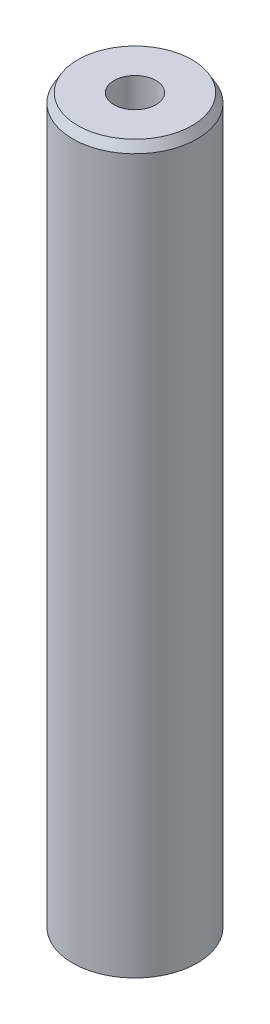
ISO-10303-21;
HEADER;
FILE_DESCRIPTION(('STEP AP214'),'2;1');
FILE_NAME('part.step','',(''),(''),'','','');
FILE_SCHEMA(('AUTOMOTIVE_DESIGN { 1 0 10303 214 1 1 1 1 }'));
ENDSEC;
DATA;
#1=APPLICATION_CONTEXT('core data for automotive mechanical design processes');
#2=APPLICATION_PROTOCOL_DEFINITION('international standard','automotive_design',2000,#1);
#3=PRODUCT_CONTEXT('',#1,'mechanical');
#4=PRODUCT('Part','Part','',(#3));
#5=PRODUCT_RELATED_PRODUCT_CATEGORY('part','',(#4));
#6=PRODUCT_DEFINITION_FORMATION('','',#4);
#7=PRODUCT_DEFINITION_CONTEXT('part definition',#1,'design');
#8=PRODUCT_DEFINITION('design','',#6,#7);
#9=PRODUCT_DEFINITION_SHAPE('','',#8);
#10=(LENGTH_UNIT() NAMED_UNIT(*) SI_UNIT(.MILLI.,.METRE.));
#11=(NAMED_UNIT(*) PLANE_ANGLE_UNIT() SI_UNIT($,.RADIAN.));
#12=(NAMED_UNIT(*) SI_UNIT($,.STERADIAN.) SOLID_ANGLE_UNIT());
#13=UNCERTAINTY_MEASURE_WITH_UNIT(LENGTH_MEASURE(1.E-05),#10,'distance_accuracy_value','');
#14=(GEOMETRIC_REPRESENTATION_CONTEXT(3) GLOBAL_UNCERTAINTY_ASSIGNED_CONTEXT((#13)) GLOBAL_UNIT_ASSIGNED_CONTEXT((#10,
#11,#12)) REPRESENTATION_CONTEXT('',''));
#15=CARTESIAN_POINT('',(0.,0.,0.));
#16=DIRECTION('',(0.,0.,1.));
#17=DIRECTION('',(1.,0.,0.));
#18=AXIS2_PLACEMENT_3D('',#15,#16,#17);
#19=CARTESIAN_POINT('',(0.,116.868068885412,0.));
#20=DIRECTION('',(0.,-1.,0.));
#21=DIRECTION('',(0.,0.,-1.));
#22=AXIS2_PLACEMENT_3D('',#19,#20,#21);
#23=CYLINDRICAL_SURFACE('',#22,10.);
#24=CARTESIAN_POINT('',(0.,115.429796169581,0.));
#25=DIRECTION('',(0.,1.,0.));
#26=DIRECTION('',(0.,0.,1.));
#27=AXIS2_PLACEMENT_3D('',#24,#25,#26);
#28=CIRCLE('',#27,10.);
#29=CARTESIAN_POINT('',(0.,115.429796169581,10.));
#30=VERTEX_POINT('',#29);
#31=EDGE_CURVE('E50',#30,#30,#28,.F.);
#32=ORIENTED_EDGE('',*,*,#31,.T.);
#33=EDGE_LOOP('',(#32));
#34=FACE_BOUND('',#33,.T.);
#35=CARTESIAN_POINT('',(0.,0.830387139653249,0.));
#36=DIRECTION('',(0.,1.,0.));
#37=DIRECTION('',(0.,0.,1.));
#38=AXIS2_PLACEMENT_3D('',#35,#36,#37);
#39=CIRCLE('',#38,10.);
#40=CARTESIAN_POINT('',(0.,0.830387139653249,10.));
#41=VERTEX_POINT('',#40);
#42=EDGE_CURVE('E51',#41,#41,#39,.T.);
#43=ORIENTED_EDGE('',*,*,#42,.T.);
#44=EDGE_LOOP('',(#43));
#45=FACE_BOUND('',#44,.T.);
#46=ADVANCED_FACE('F39',(#34,#45),#23,.T.);
#47=CARTESIAN_POINT('',(0.,116.868068885412,0.));
#48=DIRECTION('',(0.,1.,0.));
#49=DIRECTION('',(0.,0.,1.));
#50=AXIS2_PLACEMENT_3D('',#47,#48,#49);
#51=PLANE('',#50);
#52=CARTESIAN_POINT('',(0.,116.868068885412,0.));
#53=DIRECTION('',(0.,1.,0.));
#54=DIRECTION('',(0.,0.,1.));
#55=AXIS2_PLACEMENT_3D('',#52,#53,#54);
#56=CIRCLE('',#55,9.16961286034677);
#57=CARTESIAN_POINT('',(0.,116.868068885412,9.16961286034677));
#58=VERTEX_POINT('',#57);
#59=EDGE_CURVE('E54',#58,#58,#56,.T.);
#60=ORIENTED_EDGE('',*,*,#59,.T.);
#61=EDGE_LOOP('',(#60));
#62=FACE_BOUND('',#61,.T.);
#63=CARTESIAN_POINT('',(0.,116.868068885412,0.));
#64=DIRECTION('',(0.,1.,0.));
#65=DIRECTION('',(0.,0.,1.));
#66=AXIS2_PLACEMENT_3D('',#63,#64,#65);
#67=CIRCLE('',#66,3.37114388248551);
#68=CARTESIAN_POINT('',(0.,116.868068885412,3.37114388248551));
#69=VERTEX_POINT('',#68);
#70=EDGE_CURVE('E58',#69,#69,#67,.T.);
#71=ORIENTED_EDGE('',*,*,#70,.F.);
#72=EDGE_LOOP('',(#71));
#73=FACE_BOUND('',#72,.T.);
#74=ADVANCED_FACE('F69',(#62,#73),#51,.T.);
#75=CARTESIAN_POINT('',(0.,0.,0.));
#76=DIRECTION('',(0.,1.,0.));
#77=DIRECTION('',(0.,0.,1.));
#78=AXIS2_PLACEMENT_3D('',#75,#76,#77);
#79=PLANE('',#78);
#80=CARTESIAN_POINT('',(0.,0.,0.));
#81=DIRECTION('',(0.,1.,0.));
#82=DIRECTION('',(0.,0.,1.));
#83=AXIS2_PLACEMENT_3D('',#80,#81,#82);
#84=CIRCLE('',#83,8.56172728416876);
#85=CARTESIAN_POINT('',(0.,0.,8.56172728416876));
#86=VERTEX_POINT('',#85);
#87=EDGE_CURVE('E10',#86,#86,#84,.F.);
#88=ORIENTED_EDGE('',*,*,#87,.T.);
#89=EDGE_LOOP('',(#88));
#90=FACE_BOUND('',#89,.T.);
#91=CARTESIAN_POINT('',(0.,0.,0.));
#92=DIRECTION('',(0.,1.,0.));
#93=DIRECTION('',(0.,0.,1.));
#94=AXIS2_PLACEMENT_3D('',#91,#92,#93);
#95=CIRCLE('',#94,3.37114388248551);
#96=CARTESIAN_POINT('',(0.,0.,3.37114388248551));
#97=VERTEX_POINT('',#96);
#98=EDGE_CURVE('E63',#97,#97,#95,.T.);
#99=ORIENTED_EDGE('',*,*,#98,.T.);
#100=EDGE_LOOP('',(#99));
#101=FACE_BOUND('',#100,.T.);
#102=ADVANCED_FACE('F75',(#90,#101),#79,.F.);
#103=CARTESIAN_POINT('',(0.,116.868068885412,0.));
#104=DIRECTION('',(0.,-1.,0.));
#105=DIRECTION('',(0.,0.,-1.));
#106=AXIS2_PLACEMENT_3D('',#103,#104,#105);
#107=CYLINDRICAL_SURFACE('',#106,3.37114388248551);
#108=ORIENTED_EDGE('',*,*,#70,.T.);
#109=EDGE_LOOP('',(#108));
#110=FACE_BOUND('',#109,.T.);
#111=ORIENTED_EDGE('',*,*,#98,.F.);
#112=EDGE_LOOP('',(#111));
#113=FACE_BOUND('',#112,.T.);
#114=ADVANCED_FACE('F70',(#110,#113),#107,.F.);
#115=CARTESIAN_POINT('',(0.,116.868068885412,0.));
#116=DIRECTION('',(0.,-1.,0.));
#117=DIRECTION('',(0.,0.,-1.));
#118=AXIS2_PLACEMENT_3D('',#115,#116,#117);
#119=CONICAL_SURFACE('',#118,9.16961286034677,0.523598775598296);
#120=ORIENTED_EDGE('',*,*,#31,.F.);
#121=EDGE_LOOP('',(#120));
#122=FACE_BOUND('',#121,.T.);
#123=ORIENTED_EDGE('',*,*,#59,.F.);
#124=EDGE_LOOP('',(#123));
#125=FACE_BOUND('',#124,.T.);
#126=ADVANCED_FACE('F81',(#122,#125),#119,.T.);
#127=CARTESIAN_POINT('',(0.,0.830387139653249,0.));
#128=DIRECTION('',(0.,1.,0.));
#129=DIRECTION('',(0.,0.,1.));
#130=AXIS2_PLACEMENT_3D('',#127,#128,#129);
#131=CONICAL_SURFACE('',#130,10.,1.0471975511966);
#132=ORIENTED_EDGE('',*,*,#87,.F.);
#133=EDGE_LOOP('',(#132));
#134=FACE_BOUND('',#133,.T.);
#135=ORIENTED_EDGE('',*,*,#42,.F.);
#136=EDGE_LOOP('',(#135));
#137=FACE_BOUND('',#136,.T.);
#138=ADVANCED_FACE('F45',(#134,#137),#131,.T.);
#139=CLOSED_SHELL('',(#46,#74,#102,#114,#126,#138));
#140=MANIFOLD_SOLID_BREP('B2',#139);
#141=ADVANCED_BREP_SHAPE_REPRESENTATION('',(#18,#140),#14);
#142=SHAPE_DEFINITION_REPRESENTATION(#9,#141);
ENDSEC;
END-ISO-10303-21;
